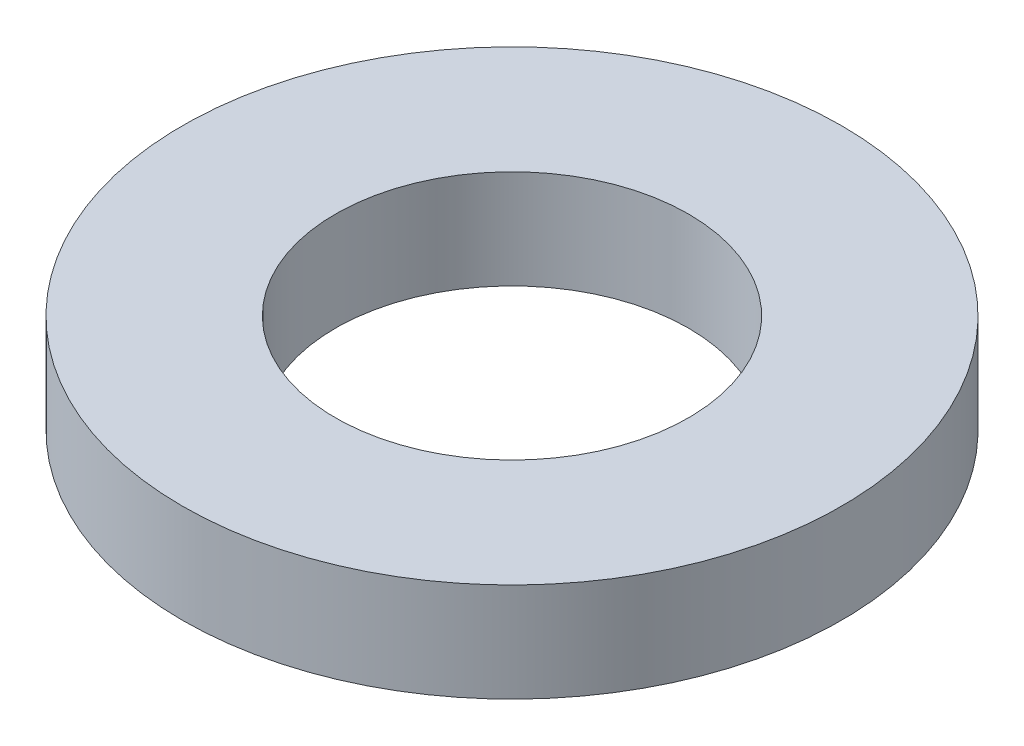
ISO-10303-21;
HEADER;
FILE_DESCRIPTION(('STEP AP214'),'2;1');
FILE_NAME('part.step','',(''),(''),'','','');
FILE_SCHEMA(('AUTOMOTIVE_DESIGN { 1 0 10303 214 1 1 1 1 }'));
ENDSEC;
DATA;
#1=APPLICATION_CONTEXT('core data for automotive mechanical design processes');
#2=APPLICATION_PROTOCOL_DEFINITION('international standard','automotive_design',2000,#1);
#3=PRODUCT_CONTEXT('',#1,'mechanical');
#4=PRODUCT('Part','Part','',(#3));
#5=PRODUCT_RELATED_PRODUCT_CATEGORY('part','',(#4));
#6=PRODUCT_DEFINITION_FORMATION('','',#4);
#7=PRODUCT_DEFINITION_CONTEXT('part definition',#1,'design');
#8=PRODUCT_DEFINITION('design','',#6,#7);
#9=PRODUCT_DEFINITION_SHAPE('','',#8);
#10=(LENGTH_UNIT() NAMED_UNIT(*) SI_UNIT(.MILLI.,.METRE.));
#11=(NAMED_UNIT(*) PLANE_ANGLE_UNIT() SI_UNIT($,.RADIAN.));
#12=(NAMED_UNIT(*) SI_UNIT($,.STERADIAN.) SOLID_ANGLE_UNIT());
#13=UNCERTAINTY_MEASURE_WITH_UNIT(LENGTH_MEASURE(1.E-05),#10,'distance_accuracy_value','');
#14=(GEOMETRIC_REPRESENTATION_CONTEXT(3) GLOBAL_UNCERTAINTY_ASSIGNED_CONTEXT((#13)) GLOBAL_UNIT_ASSIGNED_CONTEXT((#10,
#11,#12)) REPRESENTATION_CONTEXT('',''));
#15=CARTESIAN_POINT('',(0.,0.,0.));
#16=DIRECTION('',(0.,0.,1.));
#17=DIRECTION('',(1.,0.,0.));
#18=AXIS2_PLACEMENT_3D('',#15,#16,#17);
#19=CARTESIAN_POINT('',(0.,21.,0.));
#20=DIRECTION('',(0.,-1.,0.));
#21=DIRECTION('',(0.,0.,-1.));
#22=AXIS2_PLACEMENT_3D('',#19,#20,#21);
#23=CYLINDRICAL_SURFACE('',#22,70.);
#24=CARTESIAN_POINT('',(0.,21.,0.));
#25=DIRECTION('',(0.,1.,0.));
#26=DIRECTION('',(0.,0.,1.));
#27=AXIS2_PLACEMENT_3D('',#24,#25,#26);
#28=CIRCLE('',#27,70.);
#29=CARTESIAN_POINT('',(0.,21.,-70.));
#30=VERTEX_POINT('',#29);
#31=EDGE_CURVE('E10',#30,#30,#28,.T.);
#32=CARTESIAN_POINT('',(0.,0.,0.));
#33=DIRECTION('',(0.,1.,0.));
#34=DIRECTION('',(0.,0.,1.));
#35=AXIS2_PLACEMENT_3D('',#32,#33,#34);
#36=CIRCLE('',#35,70.);
#37=CARTESIAN_POINT('',(0.,0.,-70.));
#38=VERTEX_POINT('',#37);
#39=EDGE_CURVE('E37',#38,#38,#36,.T.);
#40=CARTESIAN_POINT('',(0.,21.,-70.));
#41=CARTESIAN_POINT('',(0.,20.78125,-70.));
#42=CARTESIAN_POINT('',(0.,20.5625,-70.));
#43=CARTESIAN_POINT('',(0.,20.125,-70.));
#44=CARTESIAN_POINT('',(0.,19.90625,-70.));
#45=CARTESIAN_POINT('',(0.,19.46875,-70.));
#46=CARTESIAN_POINT('',(0.,19.25,-70.));
#47=CARTESIAN_POINT('',(0.,18.8125,-70.));
#48=CARTESIAN_POINT('',(0.,18.59375,-70.));
#49=CARTESIAN_POINT('',(0.,18.15625,-70.));
#50=CARTESIAN_POINT('',(0.,17.9375,-70.));
#51=CARTESIAN_POINT('',(0.,17.5,-70.));
#52=CARTESIAN_POINT('',(0.,17.28125,-70.));
#53=CARTESIAN_POINT('',(0.,16.84375,-70.));
#54=CARTESIAN_POINT('',(0.,16.625,-70.));
#55=CARTESIAN_POINT('',(0.,16.1875,-70.));
#56=CARTESIAN_POINT('',(0.,15.96875,-70.));
#57=CARTESIAN_POINT('',(0.,15.53125,-70.));
#58=CARTESIAN_POINT('',(0.,15.3125,-70.));
#59=CARTESIAN_POINT('',(0.,14.875,-70.));
#60=CARTESIAN_POINT('',(0.,14.65625,-70.));
#61=CARTESIAN_POINT('',(0.,14.21875,-70.));
#62=CARTESIAN_POINT('',(0.,14.,-70.));
#63=CARTESIAN_POINT('',(0.,13.5625,-70.));
#64=CARTESIAN_POINT('',(0.,13.34375,-70.));
#65=CARTESIAN_POINT('',(0.,12.90625,-70.));
#66=CARTESIAN_POINT('',(0.,12.6875,-70.));
#67=CARTESIAN_POINT('',(0.,12.25,-70.));
#68=CARTESIAN_POINT('',(0.,12.03125,-70.));
#69=CARTESIAN_POINT('',(0.,11.59375,-70.));
#70=CARTESIAN_POINT('',(0.,11.375,-70.));
#71=CARTESIAN_POINT('',(0.,10.9375,-70.));
#72=CARTESIAN_POINT('',(0.,10.71875,-70.));
#73=CARTESIAN_POINT('',(0.,10.28125,-70.));
#74=CARTESIAN_POINT('',(0.,10.0625,-70.));
#75=CARTESIAN_POINT('',(0.,9.625,-70.));
#76=CARTESIAN_POINT('',(0.,9.40625,-70.));
#77=CARTESIAN_POINT('',(0.,8.96875,-70.));
#78=CARTESIAN_POINT('',(0.,8.75,-70.));
#79=CARTESIAN_POINT('',(0.,8.3125,-70.));
#80=CARTESIAN_POINT('',(0.,8.09375,-70.));
#81=CARTESIAN_POINT('',(0.,7.65625,-70.));
#82=CARTESIAN_POINT('',(0.,7.4375,-70.));
#83=CARTESIAN_POINT('',(0.,7.,-70.));
#84=CARTESIAN_POINT('',(0.,6.78125,-70.));
#85=CARTESIAN_POINT('',(0.,6.34375,-70.));
#86=CARTESIAN_POINT('',(0.,6.125,-70.));
#87=CARTESIAN_POINT('',(0.,5.6875,-70.));
#88=CARTESIAN_POINT('',(0.,5.46875,-70.));
#89=CARTESIAN_POINT('',(0.,5.03125,-70.));
#90=CARTESIAN_POINT('',(0.,4.8125,-70.));
#91=CARTESIAN_POINT('',(0.,4.375,-70.));
#92=CARTESIAN_POINT('',(0.,4.15625,-70.));
#93=CARTESIAN_POINT('',(0.,3.71875,-70.));
#94=CARTESIAN_POINT('',(0.,3.5,-70.));
#95=CARTESIAN_POINT('',(0.,3.0625,-70.));
#96=CARTESIAN_POINT('',(0.,2.84375,-70.));
#97=CARTESIAN_POINT('',(0.,2.40625,-70.));
#98=CARTESIAN_POINT('',(0.,2.1875,-70.));
#99=CARTESIAN_POINT('',(0.,1.75,-70.));
#100=CARTESIAN_POINT('',(0.,1.53125,-70.));
#101=CARTESIAN_POINT('',(0.,1.09375,-70.));
#102=CARTESIAN_POINT('',(0.,0.875000000000001,-70.));
#103=CARTESIAN_POINT('',(0.,0.4375,-70.));
#104=CARTESIAN_POINT('',(0.,0.21875,-70.));
#105=CARTESIAN_POINT('',(0.,0.,-70.));
#106=B_SPLINE_CURVE_WITH_KNOTS('',3,(#40,#41,#42,#43,#44,#45,#46,#47,#48,#49,#50,#51,#52,#53,
#54,#55,#56,#57,#58,#59,#60,#61,#62,#63,#64,#65,#66,#67,#68,#69,#70,#71,#72,#73,#74,#75,#76,#77,
#78,#79,#80,#81,#82,#83,#84,#85,#86,#87,#88,#89,#90,#91,#92,#93,#94,#95,#96,#97,#98,#99,#100,
#101,#102,#103,#104,#105),.UNSPECIFIED.,.F.,.F.,(4,2,2,2,2,2,2,2,2,2,2,2,2,2,2,2,2,2,2,2,2,2,2,
2,2,2,2,2,2,2,2,2,4),(0.,0.656249999999997,1.3125,1.96875,2.625,3.28125,3.9375,4.59375,5.25,
5.90625,6.5625,7.21875,7.875,8.53125,9.1875,9.84375,10.5,11.15625,11.8125,12.46875,13.125,
13.78125,14.4375,15.09375,15.75,16.40625,17.0625,17.71875,18.375,19.03125,19.6875,20.34375,21.),.UNSPECIFIED.);
#107=EDGE_CURVE('BSEAM40',#30,#38,#106,.T.);
#108=ORIENTED_EDGE('',*,*,#31,.F.);
#109=ORIENTED_EDGE('',*,*,#39,.T.);
#110=ORIENTED_EDGE('',*,*,#107,.T.);
#111=ORIENTED_EDGE('',*,*,#107,.F.);
#112=EDGE_LOOP('',(#108,#110,#109,#111));
#113=FACE_BOUND('',#112,.T.);
#114=ADVANCED_FACE('F40',(#113),#23,.T.);
#115=CARTESIAN_POINT('',(0.,21.,0.));
#116=DIRECTION('',(0.,1.,0.));
#117=DIRECTION('',(0.,0.,1.));
#118=AXIS2_PLACEMENT_3D('',#115,#116,#117);
#119=PLANE('',#118);
#120=CARTESIAN_POINT('',(0.,21.,0.));
#121=DIRECTION('',(0.,1.,0.));
#122=DIRECTION('',(0.,0.,1.));
#123=AXIS2_PLACEMENT_3D('',#120,#121,#122);
#124=CIRCLE('',#123,37.5);
#125=CARTESIAN_POINT('',(0.,21.,-37.5));
#126=VERTEX_POINT('',#125);
#127=EDGE_CURVE('E50',#126,#126,#124,.T.);
#128=ORIENTED_EDGE('',*,*,#127,.F.);
#129=EDGE_LOOP('',(#128));
#130=FACE_BOUND('',#129,.T.);
#131=ORIENTED_EDGE('',*,*,#31,.T.);
#132=EDGE_LOOP('',(#131));
#133=FACE_BOUND('',#132,.T.);
#134=ADVANCED_FACE('F59',(#130,#133),#119,.T.);
#135=CARTESIAN_POINT('',(0.,0.,0.));
#136=DIRECTION('',(0.,1.,0.));
#137=DIRECTION('',(0.,0.,1.));
#138=AXIS2_PLACEMENT_3D('',#135,#136,#137);
#139=PLANE('',#138);
#140=CARTESIAN_POINT('',(0.,0.,0.));
#141=DIRECTION('',(0.,1.,0.));
#142=DIRECTION('',(0.,0.,1.));
#143=AXIS2_PLACEMENT_3D('',#140,#141,#142);
#144=CIRCLE('',#143,37.5);
#145=CARTESIAN_POINT('',(0.,0.,-37.5));
#146=VERTEX_POINT('',#145);
#147=EDGE_CURVE('E47',#146,#146,#144,.T.);
#148=ORIENTED_EDGE('',*,*,#147,.T.);
#149=EDGE_LOOP('',(#148));
#150=FACE_BOUND('',#149,.T.);
#151=ORIENTED_EDGE('',*,*,#39,.F.);
#152=EDGE_LOOP('',(#151));
#153=FACE_BOUND('',#152,.T.);
#154=ADVANCED_FACE('F58',(#150,#153),#139,.F.);
#155=CARTESIAN_POINT('',(0.,21.,0.));
#156=DIRECTION('',(0.,-1.,0.));
#157=DIRECTION('',(0.,0.,-1.));
#158=AXIS2_PLACEMENT_3D('',#155,#156,#157);
#159=CYLINDRICAL_SURFACE('',#158,37.5);
#160=CARTESIAN_POINT('',(0.,21.,-37.5));
#161=CARTESIAN_POINT('',(0.,20.78125,-37.5));
#162=CARTESIAN_POINT('',(0.,20.5625,-37.5));
#163=CARTESIAN_POINT('',(0.,20.125,-37.5));
#164=CARTESIAN_POINT('',(0.,19.90625,-37.5));
#165=CARTESIAN_POINT('',(0.,19.46875,-37.5));
#166=CARTESIAN_POINT('',(0.,19.25,-37.5));
#167=CARTESIAN_POINT('',(0.,18.8125,-37.5));
#168=CARTESIAN_POINT('',(0.,18.59375,-37.5));
#169=CARTESIAN_POINT('',(0.,18.15625,-37.5));
#170=CARTESIAN_POINT('',(0.,17.9375,-37.5));
#171=CARTESIAN_POINT('',(0.,17.5,-37.5));
#172=CARTESIAN_POINT('',(0.,17.28125,-37.5));
#173=CARTESIAN_POINT('',(0.,16.84375,-37.5));
#174=CARTESIAN_POINT('',(0.,16.625,-37.5));
#175=CARTESIAN_POINT('',(0.,16.1875,-37.5));
#176=CARTESIAN_POINT('',(0.,15.96875,-37.5));
#177=CARTESIAN_POINT('',(0.,15.53125,-37.5));
#178=CARTESIAN_POINT('',(0.,15.3125,-37.5));
#179=CARTESIAN_POINT('',(0.,14.875,-37.5));
#180=CARTESIAN_POINT('',(0.,14.65625,-37.5));
#181=CARTESIAN_POINT('',(0.,14.21875,-37.5));
#182=CARTESIAN_POINT('',(0.,14.,-37.5));
#183=CARTESIAN_POINT('',(0.,13.5625,-37.5));
#184=CARTESIAN_POINT('',(0.,13.34375,-37.5));
#185=CARTESIAN_POINT('',(0.,12.90625,-37.5));
#186=CARTESIAN_POINT('',(0.,12.6875,-37.5));
#187=CARTESIAN_POINT('',(0.,12.25,-37.5));
#188=CARTESIAN_POINT('',(0.,12.03125,-37.5));
#189=CARTESIAN_POINT('',(0.,11.59375,-37.5));
#190=CARTESIAN_POINT('',(0.,11.375,-37.5));
#191=CARTESIAN_POINT('',(0.,10.9375,-37.5));
#192=CARTESIAN_POINT('',(0.,10.71875,-37.5));
#193=CARTESIAN_POINT('',(0.,10.28125,-37.5));
#194=CARTESIAN_POINT('',(0.,10.0625,-37.5));
#195=CARTESIAN_POINT('',(0.,9.625,-37.5));
#196=CARTESIAN_POINT('',(0.,9.40625,-37.5));
#197=CARTESIAN_POINT('',(0.,8.96875,-37.5));
#198=CARTESIAN_POINT('',(0.,8.75,-37.5));
#199=CARTESIAN_POINT('',(0.,8.3125,-37.5));
#200=CARTESIAN_POINT('',(0.,8.09375,-37.5));
#201=CARTESIAN_POINT('',(0.,7.65625,-37.5));
#202=CARTESIAN_POINT('',(0.,7.4375,-37.5));
#203=CARTESIAN_POINT('',(0.,7.,-37.5));
#204=CARTESIAN_POINT('',(0.,6.78125,-37.5));
#205=CARTESIAN_POINT('',(0.,6.34375,-37.5));
#206=CARTESIAN_POINT('',(0.,6.125,-37.5));
#207=CARTESIAN_POINT('',(0.,5.6875,-37.5));
#208=CARTESIAN_POINT('',(0.,5.46875,-37.5));
#209=CARTESIAN_POINT('',(0.,5.03125,-37.5));
#210=CARTESIAN_POINT('',(0.,4.8125,-37.5));
#211=CARTESIAN_POINT('',(0.,4.375,-37.5));
#212=CARTESIAN_POINT('',(0.,4.15625,-37.5));
#213=CARTESIAN_POINT('',(0.,3.71875,-37.5));
#214=CARTESIAN_POINT('',(0.,3.5,-37.5));
#215=CARTESIAN_POINT('',(0.,3.0625,-37.5));
#216=CARTESIAN_POINT('',(0.,2.84375,-37.5));
#217=CARTESIAN_POINT('',(0.,2.40625,-37.5));
#218=CARTESIAN_POINT('',(0.,2.1875,-37.5));
#219=CARTESIAN_POINT('',(0.,1.75,-37.5));
#220=CARTESIAN_POINT('',(0.,1.53125,-37.5));
#221=CARTESIAN_POINT('',(0.,1.09375,-37.5));
#222=CARTESIAN_POINT('',(0.,0.875000000000001,-37.5));
#223=CARTESIAN_POINT('',(0.,0.4375,-37.5));
#224=CARTESIAN_POINT('',(0.,0.21875,-37.5));
#225=CARTESIAN_POINT('',(0.,0.,-37.5));
#226=B_SPLINE_CURVE_WITH_KNOTS('',3,(#160,#161,#162,#163,#164,#165,#166,#167,#168,#169,#170,
#171,#172,#173,#174,#175,#176,#177,#178,#179,#180,#181,#182,#183,#184,#185,#186,#187,#188,#189,
#190,#191,#192,#193,#194,#195,#196,#197,#198,#199,#200,#201,#202,#203,#204,#205,#206,#207,#208,
#209,#210,#211,#212,#213,#214,#215,#216,#217,#218,#219,#220,#221,#222,#223,#224,#225),
.UNSPECIFIED.,.F.,.F.,(4,2,2,2,2,2,2,2,2,2,2,2,2,2,2,2,2,2,2,2,2,2,2,2,2,2,2,2,2,2,2,2,4),(0.,
0.656249999999997,1.3125,1.96875,2.625,3.28125,3.9375,4.59375,5.25,5.90625,6.5625,7.21875,7.875,
8.53125,9.1875,9.84375,10.5,11.15625,11.8125,12.46875,13.125,13.78125,14.4375,15.09375,15.75,
16.40625,17.0625,17.71875,18.375,19.03125,19.6875,20.34375,21.),.UNSPECIFIED.);
#227=EDGE_CURVE('BSEAM54',#126,#146,#226,.T.);
#228=ORIENTED_EDGE('',*,*,#127,.T.);
#229=ORIENTED_EDGE('',*,*,#147,.F.);
#230=ORIENTED_EDGE('',*,*,#227,.T.);
#231=ORIENTED_EDGE('',*,*,#227,.F.);
#232=EDGE_LOOP('',(#228,#230,#229,#231));
#233=FACE_BOUND('',#232,.T.);
#234=ADVANCED_FACE('F54',(#233),#159,.F.);
#235=CLOSED_SHELL('',(#114,#134,#154,#234));
#236=MANIFOLD_SOLID_BREP('B2',#235);
#237=ADVANCED_BREP_SHAPE_REPRESENTATION('',(#18,#236),#14);
#238=SHAPE_DEFINITION_REPRESENTATION(#9,#237);
ENDSEC;
END-ISO-10303-21;
